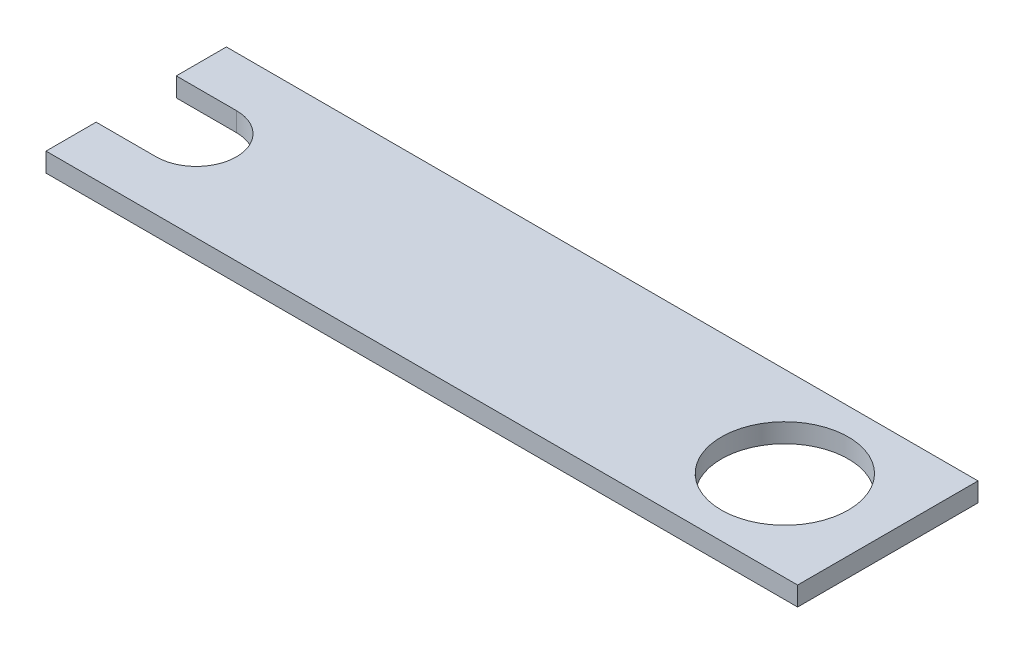
ISO-10303-21;
HEADER;
FILE_DESCRIPTION(('STEP AP214'),'2;1');
FILE_NAME('part.step','',(''),(''),'','','');
FILE_SCHEMA(('AUTOMOTIVE_DESIGN { 1 0 10303 214 1 1 1 1 }'));
ENDSEC;
DATA;
#1=APPLICATION_CONTEXT('core data for automotive mechanical design processes');
#2=APPLICATION_PROTOCOL_DEFINITION('international standard','automotive_design',2000,#1);
#3=PRODUCT_CONTEXT('',#1,'mechanical');
#4=PRODUCT('Part','Part','',(#3));
#5=PRODUCT_RELATED_PRODUCT_CATEGORY('part','',(#4));
#6=PRODUCT_DEFINITION_FORMATION('','',#4);
#7=PRODUCT_DEFINITION_CONTEXT('part definition',#1,'design');
#8=PRODUCT_DEFINITION('design','',#6,#7);
#9=PRODUCT_DEFINITION_SHAPE('','',#8);
#10=(LENGTH_UNIT() NAMED_UNIT(*) SI_UNIT(.MILLI.,.METRE.));
#11=(NAMED_UNIT(*) PLANE_ANGLE_UNIT() SI_UNIT($,.RADIAN.));
#12=(NAMED_UNIT(*) SI_UNIT($,.STERADIAN.) SOLID_ANGLE_UNIT());
#13=UNCERTAINTY_MEASURE_WITH_UNIT(LENGTH_MEASURE(1.E-05),#10,'distance_accuracy_value','');
#14=(GEOMETRIC_REPRESENTATION_CONTEXT(3) GLOBAL_UNCERTAINTY_ASSIGNED_CONTEXT((#13)) GLOBAL_UNIT_ASSIGNED_CONTEXT((#10,
#11,#12)) REPRESENTATION_CONTEXT('',''));
#15=CARTESIAN_POINT('',(0.,0.,0.));
#16=DIRECTION('',(0.,0.,1.));
#17=DIRECTION('',(1.,0.,0.));
#18=AXIS2_PLACEMENT_3D('',#15,#16,#17);
#19=CARTESIAN_POINT('',(-195.75,6.35,0.));
#20=DIRECTION('',(0.,1.,0.));
#21=DIRECTION('',(0.,0.,1.));
#22=AXIS2_PLACEMENT_3D('',#19,#20,#21);
#23=PLANE('',#22);
#24=DIRECTION('',(0.,0.,1.));
#25=VECTOR('',#24,1.);
#26=CARTESIAN_POINT('',(-215.75,6.35,13.33));
#27=LINE('',#26,#25);
#28=CARTESIAN_POINT('',(-215.75,6.35,13.33));
#29=VERTEX_POINT('',#28);
#30=CARTESIAN_POINT('',(-215.75,6.35,30.));
#31=VERTEX_POINT('',#30);
#32=EDGE_CURVE('E144',#29,#31,#27,.T.);
#33=ORIENTED_EDGE('',*,*,#32,.T.);
#34=DIRECTION('',(1.,0.,0.));
#35=VECTOR('',#34,1.);
#36=CARTESIAN_POINT('',(34.25,6.35,30.));
#37=LINE('',#36,#35);
#38=CARTESIAN_POINT('',(34.25,6.35,30.));
#39=VERTEX_POINT('',#38);
#40=EDGE_CURVE('E92',#31,#39,#37,.T.);
#41=ORIENTED_EDGE('',*,*,#40,.T.);
#42=DIRECTION('',(0.,0.,-1.));
#43=VECTOR('',#42,1.);
#44=CARTESIAN_POINT('',(34.25,6.35,-30.));
#45=LINE('',#44,#43);
#46=CARTESIAN_POINT('',(34.25,6.35,-30.));
#47=VERTEX_POINT('',#46);
#48=EDGE_CURVE('E159',#39,#47,#45,.T.);
#49=ORIENTED_EDGE('',*,*,#48,.T.);
#50=DIRECTION('',(-1.,0.,0.));
#51=VECTOR('',#50,1.);
#52=CARTESIAN_POINT('',(34.25,6.35,-30.));
#53=LINE('',#52,#51);
#54=CARTESIAN_POINT('',(-215.75,6.35,-29.9999999999999));
#55=VERTEX_POINT('',#54);
#56=EDGE_CURVE('E172',#47,#55,#53,.T.);
#57=ORIENTED_EDGE('',*,*,#56,.T.);
#58=DIRECTION('',(0.,0.,1.));
#59=VECTOR('',#58,1.);
#60=CARTESIAN_POINT('',(-215.75,6.35,-13.33));
#61=LINE('',#60,#59);
#62=CARTESIAN_POINT('',(-215.75,6.35,-13.33));
#63=VERTEX_POINT('',#62);
#64=EDGE_CURVE('E111',#55,#63,#61,.T.);
#65=ORIENTED_EDGE('',*,*,#64,.T.);
#66=DIRECTION('',(1.,0.,0.));
#67=VECTOR('',#66,1.);
#68=CARTESIAN_POINT('',(-195.75,6.35,-13.33));
#69=LINE('',#68,#67);
#70=CARTESIAN_POINT('',(-195.75,6.35,-13.33));
#71=VERTEX_POINT('',#70);
#72=EDGE_CURVE('E105',#63,#71,#69,.T.);
#73=ORIENTED_EDGE('',*,*,#72,.T.);
#74=CARTESIAN_POINT('',(-195.75,6.35,0.));
#75=DIRECTION('',(0.,-1.,0.));
#76=DIRECTION('',(0.,0.,1.));
#77=AXIS2_PLACEMENT_3D('',#74,#75,#76);
#78=CIRCLE('',#77,13.33);
#79=CARTESIAN_POINT('',(-195.75,6.35,13.33));
#80=VERTEX_POINT('',#79);
#81=EDGE_CURVE('E109',#71,#80,#78,.T.);
#82=ORIENTED_EDGE('',*,*,#81,.T.);
#83=DIRECTION('',(-1.,0.,0.));
#84=VECTOR('',#83,1.);
#85=CARTESIAN_POINT('',(-215.75,6.35,13.33));
#86=LINE('',#85,#84);
#87=EDGE_CURVE('E49',#80,#29,#86,.T.);
#88=ORIENTED_EDGE('',*,*,#87,.T.);
#89=EDGE_LOOP('',(#33,#41,#49,#57,#65,#73,#82,#88));
#90=FACE_BOUND('',#89,.T.);
#91=CARTESIAN_POINT('',(0.,6.35,0.));
#92=DIRECTION('',(0.,1.,0.));
#93=DIRECTION('',(0.,0.,1.));
#94=AXIS2_PLACEMENT_3D('',#91,#92,#93);
#95=CIRCLE('',#94,21.1);
#96=CARTESIAN_POINT('',(0.,6.35,21.1));
#97=VERTEX_POINT('',#96);
#98=EDGE_CURVE('E133',#97,#97,#95,.T.);
#99=ORIENTED_EDGE('',*,*,#98,.F.);
#100=EDGE_LOOP('',(#99));
#101=FACE_BOUND('',#100,.T.);
#102=ADVANCED_FACE('F32',(#90,#101),#23,.T.);
#103=CARTESIAN_POINT('',(-195.75,0.,0.));
#104=DIRECTION('',(0.,1.,0.));
#105=DIRECTION('',(0.,0.,1.));
#106=AXIS2_PLACEMENT_3D('',#103,#104,#105);
#107=PLANE('',#106);
#108=DIRECTION('',(0.,0.,1.));
#109=VECTOR('',#108,1.);
#110=CARTESIAN_POINT('',(-215.75,0.,13.33));
#111=LINE('',#110,#109);
#112=CARTESIAN_POINT('',(-215.75,0.,13.33));
#113=VERTEX_POINT('',#112);
#114=CARTESIAN_POINT('',(-215.75,0.,30.));
#115=VERTEX_POINT('',#114);
#116=EDGE_CURVE('E129',#113,#115,#111,.T.);
#117=ORIENTED_EDGE('',*,*,#116,.F.);
#118=DIRECTION('',(-1.,0.,0.));
#119=VECTOR('',#118,1.);
#120=CARTESIAN_POINT('',(-215.75,0.,13.33));
#121=LINE('',#120,#119);
#122=CARTESIAN_POINT('',(-195.75,0.,13.33));
#123=VERTEX_POINT('',#122);
#124=EDGE_CURVE('E84',#123,#113,#121,.T.);
#125=ORIENTED_EDGE('',*,*,#124,.F.);
#126=CARTESIAN_POINT('',(-195.75,0.,0.));
#127=DIRECTION('',(0.,-1.,0.));
#128=DIRECTION('',(0.,0.,1.));
#129=AXIS2_PLACEMENT_3D('',#126,#127,#128);
#130=CIRCLE('',#129,13.33);
#131=CARTESIAN_POINT('',(-195.75,0.,-13.33));
#132=VERTEX_POINT('',#131);
#133=EDGE_CURVE('E78',#132,#123,#130,.T.);
#134=ORIENTED_EDGE('',*,*,#133,.F.);
#135=DIRECTION('',(1.,0.,0.));
#136=VECTOR('',#135,1.);
#137=CARTESIAN_POINT('',(-195.75,0.,-13.33));
#138=LINE('',#137,#136);
#139=CARTESIAN_POINT('',(-215.75,0.,-13.33));
#140=VERTEX_POINT('',#139);
#141=EDGE_CURVE('E119',#140,#132,#138,.T.);
#142=ORIENTED_EDGE('',*,*,#141,.F.);
#143=DIRECTION('',(0.,0.,1.));
#144=VECTOR('',#143,1.);
#145=CARTESIAN_POINT('',(-215.75,0.,-13.33));
#146=LINE('',#145,#144);
#147=CARTESIAN_POINT('',(-215.75,0.,-29.9999999999999));
#148=VERTEX_POINT('',#147);
#149=EDGE_CURVE('E139',#148,#140,#146,.T.);
#150=ORIENTED_EDGE('',*,*,#149,.F.);
#151=DIRECTION('',(-1.,0.,0.));
#152=VECTOR('',#151,1.);
#153=CARTESIAN_POINT('',(34.25,0.,-30.));
#154=LINE('',#153,#152);
#155=CARTESIAN_POINT('',(34.25,0.,-30.));
#156=VERTEX_POINT('',#155);
#157=EDGE_CURVE('E137',#156,#148,#154,.T.);
#158=ORIENTED_EDGE('',*,*,#157,.F.);
#159=DIRECTION('',(0.,0.,-1.));
#160=VECTOR('',#159,1.);
#161=CARTESIAN_POINT('',(34.25,0.,-30.));
#162=LINE('',#161,#160);
#163=CARTESIAN_POINT('',(34.25,0.,30.));
#164=VERTEX_POINT('',#163);
#165=EDGE_CURVE('E135',#164,#156,#162,.T.);
#166=ORIENTED_EDGE('',*,*,#165,.F.);
#167=DIRECTION('',(1.,0.,0.));
#168=VECTOR('',#167,1.);
#169=CARTESIAN_POINT('',(34.25,0.,30.));
#170=LINE('',#169,#168);
#171=EDGE_CURVE('E132',#115,#164,#170,.T.);
#172=ORIENTED_EDGE('',*,*,#171,.F.);
#173=EDGE_LOOP('',(#117,#125,#134,#142,#150,#158,#166,#172));
#174=FACE_BOUND('',#173,.T.);
#175=CARTESIAN_POINT('',(0.,0.,0.));
#176=DIRECTION('',(0.,1.,0.));
#177=DIRECTION('',(0.,0.,1.));
#178=AXIS2_PLACEMENT_3D('',#175,#176,#177);
#179=CIRCLE('',#178,21.1);
#180=CARTESIAN_POINT('',(0.,0.,21.1));
#181=VERTEX_POINT('',#180);
#182=EDGE_CURVE('E178',#181,#181,#179,.T.);
#183=ORIENTED_EDGE('',*,*,#182,.T.);
#184=EDGE_LOOP('',(#183));
#185=FACE_BOUND('',#184,.T.);
#186=ADVANCED_FACE('F163',(#174,#185),#107,.F.);
#187=CARTESIAN_POINT('',(-215.75,6.35,13.33));
#188=DIRECTION('',(1.,0.,0.));
#189=DIRECTION('',(0.,0.,-1.));
#190=AXIS2_PLACEMENT_3D('',#187,#188,#189);
#191=PLANE('',#190);
#192=ORIENTED_EDGE('',*,*,#116,.T.);
#193=DIRECTION('',(0.,-1.,0.));
#194=VECTOR('',#193,1.);
#195=CARTESIAN_POINT('',(-215.75,6.35,30.));
#196=LINE('',#195,#194);
#197=EDGE_CURVE('E11',#31,#115,#196,.T.);
#198=ORIENTED_EDGE('',*,*,#197,.F.);
#199=ORIENTED_EDGE('',*,*,#32,.F.);
#200=DIRECTION('',(0.,-1.,0.));
#201=VECTOR('',#200,1.);
#202=CARTESIAN_POINT('',(-215.75,6.35,13.33));
#203=LINE('',#202,#201);
#204=EDGE_CURVE('E125',#29,#113,#203,.T.);
#205=ORIENTED_EDGE('',*,*,#204,.T.);
#206=EDGE_LOOP('',(#192,#198,#199,#205));
#207=FACE_BOUND('',#206,.T.);
#208=ADVANCED_FACE('F34',(#207),#191,.F.);
#209=CARTESIAN_POINT('',(34.25,6.35,30.));
#210=DIRECTION('',(0.,0.,-1.));
#211=DIRECTION('',(-1.,0.,0.));
#212=AXIS2_PLACEMENT_3D('',#209,#210,#211);
#213=PLANE('',#212);
#214=ORIENTED_EDGE('',*,*,#171,.T.);
#215=DIRECTION('',(0.,-1.,0.));
#216=VECTOR('',#215,1.);
#217=CARTESIAN_POINT('',(34.25,6.35,30.));
#218=LINE('',#217,#216);
#219=EDGE_CURVE('E41',#39,#164,#218,.T.);
#220=ORIENTED_EDGE('',*,*,#219,.F.);
#221=ORIENTED_EDGE('',*,*,#40,.F.);
#222=ORIENTED_EDGE('',*,*,#197,.T.);
#223=EDGE_LOOP('',(#214,#220,#221,#222));
#224=FACE_BOUND('',#223,.T.);
#225=ADVANCED_FACE('F206',(#224),#213,.F.);
#226=CARTESIAN_POINT('',(34.25,6.35,-30.));
#227=DIRECTION('',(-1.,0.,0.));
#228=DIRECTION('',(0.,0.,1.));
#229=AXIS2_PLACEMENT_3D('',#226,#227,#228);
#230=PLANE('',#229);
#231=ORIENTED_EDGE('',*,*,#165,.T.);
#232=DIRECTION('',(0.,-1.,0.));
#233=VECTOR('',#232,1.);
#234=CARTESIAN_POINT('',(34.25,6.35,-30.));
#235=LINE('',#234,#233);
#236=EDGE_CURVE('E151',#47,#156,#235,.T.);
#237=ORIENTED_EDGE('',*,*,#236,.F.);
#238=ORIENTED_EDGE('',*,*,#48,.F.);
#239=ORIENTED_EDGE('',*,*,#219,.T.);
#240=EDGE_LOOP('',(#231,#237,#238,#239));
#241=FACE_BOUND('',#240,.T.);
#242=ADVANCED_FACE('F157',(#241),#230,.F.);
#243=CARTESIAN_POINT('',(34.25,6.35,-30.));
#244=DIRECTION('',(0.,0.,1.));
#245=DIRECTION('',(1.,0.,0.));
#246=AXIS2_PLACEMENT_3D('',#243,#244,#245);
#247=PLANE('',#246);
#248=ORIENTED_EDGE('',*,*,#157,.T.);
#249=DIRECTION('',(0.,-1.,0.));
#250=VECTOR('',#249,1.);
#251=CARTESIAN_POINT('',(-215.75,6.35,-29.9999999999999));
#252=LINE('',#251,#250);
#253=EDGE_CURVE('E148',#55,#148,#252,.T.);
#254=ORIENTED_EDGE('',*,*,#253,.F.);
#255=ORIENTED_EDGE('',*,*,#56,.F.);
#256=ORIENTED_EDGE('',*,*,#236,.T.);
#257=EDGE_LOOP('',(#248,#254,#255,#256));
#258=FACE_BOUND('',#257,.T.);
#259=ADVANCED_FACE('F168',(#258),#247,.F.);
#260=CARTESIAN_POINT('',(-215.75,6.35,-13.33));
#261=DIRECTION('',(1.,0.,0.));
#262=DIRECTION('',(0.,0.,-1.));
#263=AXIS2_PLACEMENT_3D('',#260,#261,#262);
#264=PLANE('',#263);
#265=ORIENTED_EDGE('',*,*,#149,.T.);
#266=DIRECTION('',(0.,-1.,0.));
#267=VECTOR('',#266,1.);
#268=CARTESIAN_POINT('',(-215.75,6.35,-13.33));
#269=LINE('',#268,#267);
#270=EDGE_CURVE('E120',#63,#140,#269,.T.);
#271=ORIENTED_EDGE('',*,*,#270,.F.);
#272=ORIENTED_EDGE('',*,*,#64,.F.);
#273=ORIENTED_EDGE('',*,*,#253,.T.);
#274=EDGE_LOOP('',(#265,#271,#272,#273));
#275=FACE_BOUND('',#274,.T.);
#276=ADVANCED_FACE('F171',(#275),#264,.F.);
#277=CARTESIAN_POINT('',(-195.75,6.35,-13.33));
#278=DIRECTION('',(0.,0.,-1.));
#279=DIRECTION('',(-1.,0.,0.));
#280=AXIS2_PLACEMENT_3D('',#277,#278,#279);
#281=PLANE('',#280);
#282=ORIENTED_EDGE('',*,*,#141,.T.);
#283=DIRECTION('',(0.,-1.,0.));
#284=VECTOR('',#283,1.);
#285=CARTESIAN_POINT('',(-195.75,6.35,-13.33));
#286=LINE('',#285,#284);
#287=EDGE_CURVE('E116',#71,#132,#286,.T.);
#288=ORIENTED_EDGE('',*,*,#287,.F.);
#289=ORIENTED_EDGE('',*,*,#72,.F.);
#290=ORIENTED_EDGE('',*,*,#270,.T.);
#291=EDGE_LOOP('',(#282,#288,#289,#290));
#292=FACE_BOUND('',#291,.T.);
#293=ADVANCED_FACE('F117',(#292),#281,.F.);
#294=CARTESIAN_POINT('',(-195.75,6.35,0.));
#295=DIRECTION('',(0.,-1.,0.));
#296=DIRECTION('',(0.,0.,-1.));
#297=AXIS2_PLACEMENT_3D('',#294,#295,#296);
#298=CYLINDRICAL_SURFACE('',#297,13.33);
#299=ORIENTED_EDGE('',*,*,#133,.T.);
#300=DIRECTION('',(0.,-1.,0.));
#301=VECTOR('',#300,1.);
#302=CARTESIAN_POINT('',(-195.75,6.35,13.33));
#303=LINE('',#302,#301);
#304=EDGE_CURVE('E121',#80,#123,#303,.T.);
#305=ORIENTED_EDGE('',*,*,#304,.F.);
#306=ORIENTED_EDGE('',*,*,#81,.F.);
#307=ORIENTED_EDGE('',*,*,#287,.T.);
#308=EDGE_LOOP('',(#299,#305,#306,#307));
#309=FACE_BOUND('',#308,.T.);
#310=ADVANCED_FACE('F123',(#309),#298,.F.);
#311=CARTESIAN_POINT('',(-215.75,6.35,13.33));
#312=DIRECTION('',(0.,0.,1.));
#313=DIRECTION('',(1.,0.,0.));
#314=AXIS2_PLACEMENT_3D('',#311,#312,#313);
#315=PLANE('',#314);
#316=ORIENTED_EDGE('',*,*,#124,.T.);
#317=ORIENTED_EDGE('',*,*,#204,.F.);
#318=ORIENTED_EDGE('',*,*,#87,.F.);
#319=ORIENTED_EDGE('',*,*,#304,.T.);
#320=EDGE_LOOP('',(#316,#317,#318,#319));
#321=FACE_BOUND('',#320,.T.);
#322=ADVANCED_FACE('F194',(#321),#315,.F.);
#323=CARTESIAN_POINT('',(0.,6.35,0.));
#324=DIRECTION('',(0.,-1.,0.));
#325=DIRECTION('',(0.,0.,-1.));
#326=AXIS2_PLACEMENT_3D('',#323,#324,#325);
#327=CYLINDRICAL_SURFACE('',#326,21.1);
#328=ORIENTED_EDGE('',*,*,#98,.T.);
#329=EDGE_LOOP('',(#328));
#330=FACE_BOUND('',#329,.T.);
#331=ORIENTED_EDGE('',*,*,#182,.F.);
#332=EDGE_LOOP('',(#331));
#333=FACE_BOUND('',#332,.T.);
#334=ADVANCED_FACE('F184',(#330,#333),#327,.F.);
#335=CLOSED_SHELL('',(#102,#186,#208,#225,#242,#259,#276,#293,#310,#322,#334));
#336=MANIFOLD_SOLID_BREP('B2',#335);
#337=ADVANCED_BREP_SHAPE_REPRESENTATION('',(#18,#336),#14);
#338=SHAPE_DEFINITION_REPRESENTATION(#9,#337);
ENDSEC;
END-ISO-10303-21;
